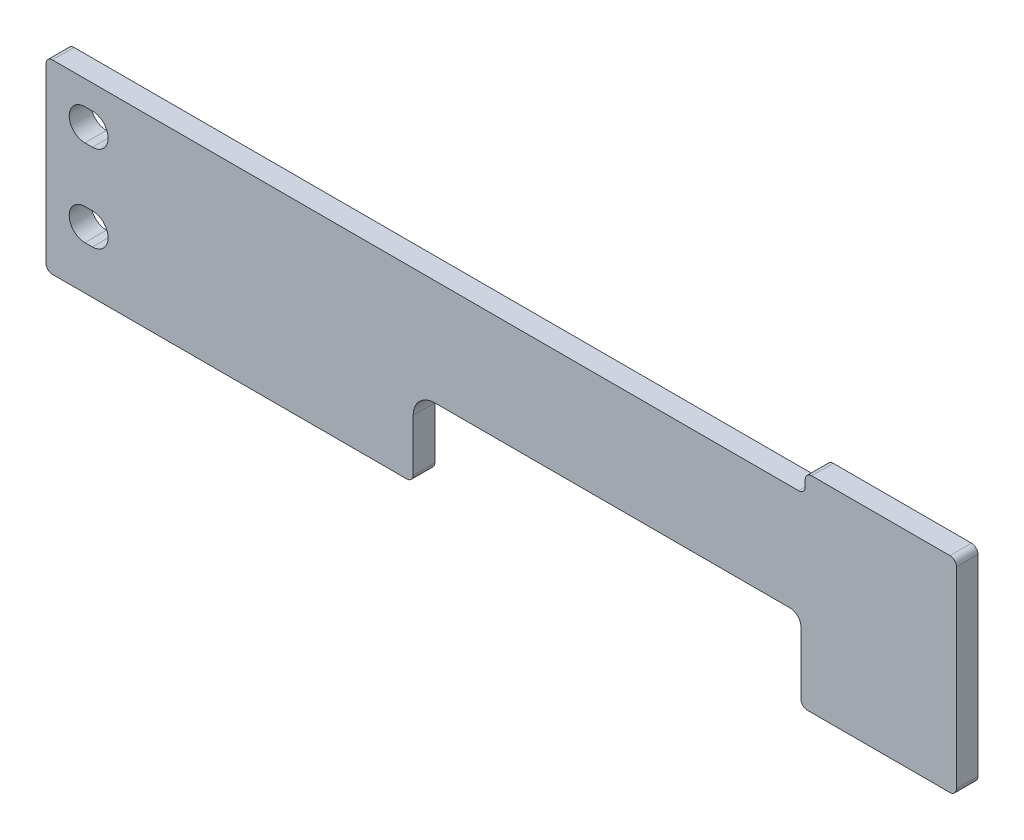
ISO-10303-21;
HEADER;
FILE_DESCRIPTION(('STEP AP214'),'2;1');
FILE_NAME('part.step','',(''),(''),'','','');
FILE_SCHEMA(('AUTOMOTIVE_DESIGN { 1 0 10303 214 1 1 1 1 }'));
ENDSEC;
DATA;
#1=APPLICATION_CONTEXT('core data for automotive mechanical design processes');
#2=APPLICATION_PROTOCOL_DEFINITION('international standard','automotive_design',2000,#1);
#3=PRODUCT_CONTEXT('',#1,'mechanical');
#4=PRODUCT('Part','Part','',(#3));
#5=PRODUCT_RELATED_PRODUCT_CATEGORY('part','',(#4));
#6=PRODUCT_DEFINITION_FORMATION('','',#4);
#7=PRODUCT_DEFINITION_CONTEXT('part definition',#1,'design');
#8=PRODUCT_DEFINITION('design','',#6,#7);
#9=PRODUCT_DEFINITION_SHAPE('','',#8);
#10=(LENGTH_UNIT() NAMED_UNIT(*) SI_UNIT(.MILLI.,.METRE.));
#11=(NAMED_UNIT(*) PLANE_ANGLE_UNIT() SI_UNIT($,.RADIAN.));
#12=(NAMED_UNIT(*) SI_UNIT($,.STERADIAN.) SOLID_ANGLE_UNIT());
#13=UNCERTAINTY_MEASURE_WITH_UNIT(LENGTH_MEASURE(1.E-05),#10,'distance_accuracy_value','');
#14=(GEOMETRIC_REPRESENTATION_CONTEXT(3) GLOBAL_UNCERTAINTY_ASSIGNED_CONTEXT((#13)) GLOBAL_UNIT_ASSIGNED_CONTEXT((#10,
#11,#12)) REPRESENTATION_CONTEXT('',''));
#15=CARTESIAN_POINT('',(0.,0.,0.));
#16=DIRECTION('',(0.,0.,1.));
#17=DIRECTION('',(1.,0.,0.));
#18=AXIS2_PLACEMENT_3D('',#15,#16,#17);
#19=CARTESIAN_POINT('',(-418.5,-12.,10.));
#20=DIRECTION('',(0.,0.,1.));
#21=DIRECTION('',(1.,0.,0.));
#22=AXIS2_PLACEMENT_3D('',#19,#20,#21);
#23=PLANE('',#22);
#24=DIRECTION('',(1.,0.,0.));
#25=VECTOR('',#24,1.);
#26=CARTESIAN_POINT('',(-403.5,-74.75,10.));
#27=LINE('',#26,#25);
#28=CARTESIAN_POINT('',(-403.5,-74.75,10.));
#29=VERTEX_POINT('',#28);
#30=CARTESIAN_POINT('',(-400.,-74.75,10.));
#31=VERTEX_POINT('',#30);
#32=EDGE_CURVE('E262',#29,#31,#27,.T.);
#33=ORIENTED_EDGE('',*,*,#32,.F.);
#34=CARTESIAN_POINT('',(-403.5,-67.5,10.));
#35=DIRECTION('',(0.,0.,1.));
#36=DIRECTION('',(1.,0.,0.));
#37=AXIS2_PLACEMENT_3D('',#34,#35,#36);
#38=CIRCLE('',#37,7.25);
#39=CARTESIAN_POINT('',(-403.5,-60.25,10.));
#40=VERTEX_POINT('',#39);
#41=EDGE_CURVE('E260',#40,#29,#38,.T.);
#42=ORIENTED_EDGE('',*,*,#41,.F.);
#43=DIRECTION('',(-1.,0.,0.));
#44=VECTOR('',#43,1.);
#45=CARTESIAN_POINT('',(-400.,-60.25,10.));
#46=LINE('',#45,#44);
#47=CARTESIAN_POINT('',(-400.,-60.25,10.));
#48=VERTEX_POINT('',#47);
#49=EDGE_CURVE('E268',#48,#40,#46,.T.);
#50=ORIENTED_EDGE('',*,*,#49,.F.);
#51=CARTESIAN_POINT('',(-400.,-67.5,10.));
#52=DIRECTION('',(0.,0.,1.));
#53=DIRECTION('',(1.,0.,0.));
#54=AXIS2_PLACEMENT_3D('',#51,#52,#53);
#55=CIRCLE('',#54,7.25);
#56=EDGE_CURVE('E265',#31,#48,#55,.T.);
#57=ORIENTED_EDGE('',*,*,#56,.F.);
#58=EDGE_LOOP('',(#33,#42,#50,#57));
#59=FACE_BOUND('',#58,.T.);
#60=CARTESIAN_POINT('',(-418.5,-12.,10.));
#61=DIRECTION('',(0.,0.,1.));
#62=DIRECTION('',(1.,0.,0.));
#63=AXIS2_PLACEMENT_3D('',#60,#61,#62);
#64=CIRCLE('',#63,3.);
#65=CARTESIAN_POINT('',(-418.5,-9.00000000000004,10.));
#66=VERTEX_POINT('',#65);
#67=CARTESIAN_POINT('',(-421.5,-12.,10.));
#68=VERTEX_POINT('',#67);
#69=EDGE_CURVE('E291',#66,#68,#64,.T.);
#70=ORIENTED_EDGE('',*,*,#69,.T.);
#71=DIRECTION('',(0.,-1.,0.));
#72=VECTOR('',#71,1.);
#73=CARTESIAN_POINT('',(-421.5,-12.,10.));
#74=LINE('',#73,#72);
#75=CARTESIAN_POINT('',(-421.5,-92.,9.99999999999999));
#76=VERTEX_POINT('',#75);
#77=EDGE_CURVE('E294',#68,#76,#74,.T.);
#78=ORIENTED_EDGE('',*,*,#77,.T.);
#79=CARTESIAN_POINT('',(-418.5,-92.,10.));
#80=DIRECTION('',(0.,0.,1.));
#81=DIRECTION('',(1.,0.,0.));
#82=AXIS2_PLACEMENT_3D('',#79,#80,#81);
#83=CIRCLE('',#82,3.);
#84=CARTESIAN_POINT('',(-418.5,-95.,10.));
#85=VERTEX_POINT('',#84);
#86=EDGE_CURVE('E297',#76,#85,#83,.T.);
#87=ORIENTED_EDGE('',*,*,#86,.T.);
#88=DIRECTION('',(1.,0.,0.));
#89=VECTOR('',#88,1.);
#90=CARTESIAN_POINT('',(-418.5,-95.,10.));
#91=LINE('',#90,#89);
#92=CARTESIAN_POINT('',(-254.5,-95.,10.));
#93=VERTEX_POINT('',#92);
#94=EDGE_CURVE('E299',#85,#93,#91,.T.);
#95=ORIENTED_EDGE('',*,*,#94,.T.);
#96=CARTESIAN_POINT('',(-254.5,-92.,10.));
#97=DIRECTION('',(0.,0.,1.));
#98=DIRECTION('',(1.,0.,0.));
#99=AXIS2_PLACEMENT_3D('',#96,#97,#98);
#100=CIRCLE('',#99,3.);
#101=CARTESIAN_POINT('',(-251.5,-92.,9.99999999999999));
#102=VERTEX_POINT('',#101);
#103=EDGE_CURVE('E301',#93,#102,#100,.T.);
#104=ORIENTED_EDGE('',*,*,#103,.T.);
#105=DIRECTION('',(0.,1.,0.));
#106=VECTOR('',#105,1.);
#107=CARTESIAN_POINT('',(-251.5,-92.,9.99999999999999));
#108=LINE('',#107,#106);
#109=CARTESIAN_POINT('',(-251.5,-68.,10.));
#110=VERTEX_POINT('',#109);
#111=EDGE_CURVE('E303',#102,#110,#108,.T.);
#112=ORIENTED_EDGE('',*,*,#111,.T.);
#113=CARTESIAN_POINT('',(-241.5,-68.,10.));
#114=DIRECTION('',(0.,0.,-1.));
#115=DIRECTION('',(-1.,0.,0.));
#116=AXIS2_PLACEMENT_3D('',#113,#114,#115);
#117=CIRCLE('',#116,10.);
#118=CARTESIAN_POINT('',(-241.5,-58.,10.));
#119=VERTEX_POINT('',#118);
#120=EDGE_CURVE('E305',#110,#119,#117,.T.);
#121=ORIENTED_EDGE('',*,*,#120,.T.);
#122=DIRECTION('',(1.,0.,0.));
#123=VECTOR('',#122,1.);
#124=CARTESIAN_POINT('',(-241.5,-58.,10.));
#125=LINE('',#124,#123);
#126=CARTESIAN_POINT('',(-77.,-58.,10.));
#127=VERTEX_POINT('',#126);
#128=EDGE_CURVE('E307',#119,#127,#125,.T.);
#129=ORIENTED_EDGE('',*,*,#128,.T.);
#130=CARTESIAN_POINT('',(-77.,-63.,10.));
#131=DIRECTION('',(0.,0.,-1.));
#132=DIRECTION('',(-1.,0.,0.));
#133=AXIS2_PLACEMENT_3D('',#130,#131,#132);
#134=CIRCLE('',#133,5.00000000000001);
#135=CARTESIAN_POINT('',(-72.,-63.,10.));
#136=VERTEX_POINT('',#135);
#137=EDGE_CURVE('E309',#127,#136,#134,.T.);
#138=ORIENTED_EDGE('',*,*,#137,.T.);
#139=DIRECTION('',(0.,-1.,0.));
#140=VECTOR('',#139,1.);
#141=CARTESIAN_POINT('',(-72.,-63.,10.));
#142=LINE('',#141,#140);
#143=CARTESIAN_POINT('',(-72.,-92.,10.));
#144=VERTEX_POINT('',#143);
#145=EDGE_CURVE('E311',#136,#144,#142,.T.);
#146=ORIENTED_EDGE('',*,*,#145,.T.);
#147=CARTESIAN_POINT('',(-69.,-92.,10.));
#148=DIRECTION('',(0.,0.,1.));
#149=DIRECTION('',(1.,0.,0.));
#150=AXIS2_PLACEMENT_3D('',#147,#148,#149);
#151=CIRCLE('',#150,3.);
#152=CARTESIAN_POINT('',(-69.,-95.,10.));
#153=VERTEX_POINT('',#152);
#154=EDGE_CURVE('E313',#144,#153,#151,.T.);
#155=ORIENTED_EDGE('',*,*,#154,.T.);
#156=DIRECTION('',(1.,0.,0.));
#157=VECTOR('',#156,1.);
#158=CARTESIAN_POINT('',(-69.,-95.,10.));
#159=LINE('',#158,#157);
#160=CARTESIAN_POINT('',(-3.,-95.,10.));
#161=VERTEX_POINT('',#160);
#162=EDGE_CURVE('E315',#153,#161,#159,.T.);
#163=ORIENTED_EDGE('',*,*,#162,.T.);
#164=CARTESIAN_POINT('',(-3.,-92.,10.));
#165=DIRECTION('',(0.,0.,1.));
#166=DIRECTION('',(1.,0.,0.));
#167=AXIS2_PLACEMENT_3D('',#164,#165,#166);
#168=CIRCLE('',#167,3.);
#169=CARTESIAN_POINT('',(0.,-92.,9.99999999999999));
#170=VERTEX_POINT('',#169);
#171=EDGE_CURVE('E317',#161,#170,#168,.T.);
#172=ORIENTED_EDGE('',*,*,#171,.T.);
#173=DIRECTION('',(0.,1.,0.));
#174=VECTOR('',#173,1.);
#175=CARTESIAN_POINT('',(0.,-92.,9.99999999999999));
#176=LINE('',#175,#174);
#177=CARTESIAN_POINT('',(0.,-3.00000000000002,10.));
#178=VERTEX_POINT('',#177);
#179=EDGE_CURVE('E319',#170,#178,#176,.T.);
#180=ORIENTED_EDGE('',*,*,#179,.T.);
#181=CARTESIAN_POINT('',(-3.,-3.,10.));
#182=DIRECTION('',(0.,0.,1.));
#183=DIRECTION('',(-1.,0.,0.));
#184=AXIS2_PLACEMENT_3D('',#181,#182,#183);
#185=CIRCLE('',#184,3.);
#186=CARTESIAN_POINT('',(-3.00000000000002,0.,10.));
#187=VERTEX_POINT('',#186);
#188=EDGE_CURVE('E321',#178,#187,#185,.T.);
#189=ORIENTED_EDGE('',*,*,#188,.T.);
#190=DIRECTION('',(-1.,0.,0.));
#191=VECTOR('',#190,1.);
#192=CARTESIAN_POINT('',(-3.00000000000002,0.,10.));
#193=LINE('',#192,#191);
#194=CARTESIAN_POINT('',(-67.,0.,10.));
#195=VERTEX_POINT('',#194);
#196=EDGE_CURVE('E323',#187,#195,#193,.T.);
#197=ORIENTED_EDGE('',*,*,#196,.T.);
#198=CARTESIAN_POINT('',(-67.,-3.,10.));
#199=DIRECTION('',(0.,0.,1.));
#200=DIRECTION('',(1.,0.,0.));
#201=AXIS2_PLACEMENT_3D('',#198,#199,#200);
#202=CIRCLE('',#201,3.);
#203=CARTESIAN_POINT('',(-70.,-3.,10.));
#204=VERTEX_POINT('',#203);
#205=EDGE_CURVE('E325',#195,#204,#202,.T.);
#206=ORIENTED_EDGE('',*,*,#205,.T.);
#207=DIRECTION('',(0.,-1.,0.));
#208=VECTOR('',#207,1.);
#209=CARTESIAN_POINT('',(-70.,-3.,10.));
#210=LINE('',#209,#208);
#211=CARTESIAN_POINT('',(-70.,-6.00000000000001,10.));
#212=VERTEX_POINT('',#211);
#213=EDGE_CURVE('E327',#204,#212,#210,.T.);
#214=ORIENTED_EDGE('',*,*,#213,.T.);
#215=CARTESIAN_POINT('',(-73.,-6.00000000000001,10.));
#216=DIRECTION('',(0.,0.,-1.));
#217=DIRECTION('',(-1.,0.,0.));
#218=AXIS2_PLACEMENT_3D('',#215,#216,#217);
#219=CIRCLE('',#218,2.99999999999999);
#220=CARTESIAN_POINT('',(-73.,-9.00000000000001,10.));
#221=VERTEX_POINT('',#220);
#222=EDGE_CURVE('E329',#212,#221,#219,.T.);
#223=ORIENTED_EDGE('',*,*,#222,.T.);
#224=DIRECTION('',(-1.,0.,0.));
#225=VECTOR('',#224,1.);
#226=CARTESIAN_POINT('',(-73.,-9.00000000000001,10.));
#227=LINE('',#226,#225);
#228=EDGE_CURVE('E331',#221,#66,#227,.T.);
#229=ORIENTED_EDGE('',*,*,#228,.T.);
#230=EDGE_LOOP('',(#70,#78,#87,#95,#104,#112,#121,#129,#138,#146,#155,#163,#172,#180,#189,#197,
#206,#214,#223,#229));
#231=FACE_BOUND('',#230,.T.);
#232=DIRECTION('',(1.,0.,0.));
#233=VECTOR('',#232,1.);
#234=CARTESIAN_POINT('',(-403.5,-34.75,10.));
#235=LINE('',#234,#233);
#236=CARTESIAN_POINT('',(-403.5,-34.75,10.));
#237=VERTEX_POINT('',#236);
#238=CARTESIAN_POINT('',(-400.,-34.75,10.));
#239=VERTEX_POINT('',#238);
#240=EDGE_CURVE('E232',#237,#239,#235,.T.);
#241=ORIENTED_EDGE('',*,*,#240,.F.);
#242=CARTESIAN_POINT('',(-403.5,-27.5,10.));
#243=DIRECTION('',(0.,0.,1.));
#244=DIRECTION('',(1.,0.,0.));
#245=AXIS2_PLACEMENT_3D('',#242,#243,#244);
#246=CIRCLE('',#245,7.25);
#247=CARTESIAN_POINT('',(-403.5,-20.25,10.));
#248=VERTEX_POINT('',#247);
#249=EDGE_CURVE('E224',#248,#237,#246,.T.);
#250=ORIENTED_EDGE('',*,*,#249,.F.);
#251=DIRECTION('',(-1.,0.,0.));
#252=VECTOR('',#251,1.);
#253=CARTESIAN_POINT('',(-400.,-20.25,10.));
#254=LINE('',#253,#252);
#255=CARTESIAN_POINT('',(-400.,-20.25,10.));
#256=VERTEX_POINT('',#255);
#257=EDGE_CURVE('E246',#256,#248,#254,.T.);
#258=ORIENTED_EDGE('',*,*,#257,.F.);
#259=CARTESIAN_POINT('',(-400.,-27.5,10.));
#260=DIRECTION('',(0.,0.,1.));
#261=DIRECTION('',(1.,0.,0.));
#262=AXIS2_PLACEMENT_3D('',#259,#260,#261);
#263=CIRCLE('',#262,7.25);
#264=EDGE_CURVE('E244',#239,#256,#263,.T.);
#265=ORIENTED_EDGE('',*,*,#264,.F.);
#266=EDGE_LOOP('',(#241,#250,#258,#265));
#267=FACE_BOUND('',#266,.T.);
#268=ADVANCED_FACE('F39',(#59,#231,#267),#23,.T.);
#269=CARTESIAN_POINT('',(-418.5,-12.,0.));
#270=DIRECTION('',(0.,0.,1.));
#271=DIRECTION('',(1.,0.,0.));
#272=AXIS2_PLACEMENT_3D('',#269,#270,#271);
#273=PLANE('',#272);
#274=CARTESIAN_POINT('',(-403.5,-67.5,0.));
#275=DIRECTION('',(0.,0.,1.));
#276=DIRECTION('',(1.,0.,0.));
#277=AXIS2_PLACEMENT_3D('',#274,#275,#276);
#278=CIRCLE('',#277,7.25);
#279=CARTESIAN_POINT('',(-403.5,-60.25,0.));
#280=VERTEX_POINT('',#279);
#281=CARTESIAN_POINT('',(-403.5,-74.75,0.));
#282=VERTEX_POINT('',#281);
#283=EDGE_CURVE('E240',#280,#282,#278,.T.);
#284=ORIENTED_EDGE('',*,*,#283,.T.);
#285=DIRECTION('',(1.,0.,0.));
#286=VECTOR('',#285,1.);
#287=CARTESIAN_POINT('',(-403.5,-74.75,0.));
#288=LINE('',#287,#286);
#289=CARTESIAN_POINT('',(-400.,-74.75,0.));
#290=VERTEX_POINT('',#289);
#291=EDGE_CURVE('E273',#282,#290,#288,.T.);
#292=ORIENTED_EDGE('',*,*,#291,.T.);
#293=CARTESIAN_POINT('',(-400.,-67.5,0.));
#294=DIRECTION('',(0.,0.,1.));
#295=DIRECTION('',(1.,0.,0.));
#296=AXIS2_PLACEMENT_3D('',#293,#294,#295);
#297=CIRCLE('',#296,7.25);
#298=CARTESIAN_POINT('',(-400.,-60.25,0.));
#299=VERTEX_POINT('',#298);
#300=EDGE_CURVE('E276',#290,#299,#297,.T.);
#301=ORIENTED_EDGE('',*,*,#300,.T.);
#302=DIRECTION('',(-1.,0.,0.));
#303=VECTOR('',#302,1.);
#304=CARTESIAN_POINT('',(-400.,-60.25,0.));
#305=LINE('',#304,#303);
#306=EDGE_CURVE('E263',#299,#280,#305,.T.);
#307=ORIENTED_EDGE('',*,*,#306,.T.);
#308=EDGE_LOOP('',(#284,#292,#301,#307));
#309=FACE_BOUND('',#308,.T.);
#310=CARTESIAN_POINT('',(-418.5,-12.,0.));
#311=DIRECTION('',(0.,0.,1.));
#312=DIRECTION('',(1.,0.,0.));
#313=AXIS2_PLACEMENT_3D('',#310,#311,#312);
#314=CIRCLE('',#313,3.);
#315=CARTESIAN_POINT('',(-418.5,-9.00000000000004,0.));
#316=VERTEX_POINT('',#315);
#317=CARTESIAN_POINT('',(-421.5,-12.,0.));
#318=VERTEX_POINT('',#317);
#319=EDGE_CURVE('E290',#316,#318,#314,.T.);
#320=ORIENTED_EDGE('',*,*,#319,.F.);
#321=DIRECTION('',(-1.,0.,0.));
#322=VECTOR('',#321,1.);
#323=CARTESIAN_POINT('',(-73.,-9.00000000000001,0.));
#324=LINE('',#323,#322);
#325=CARTESIAN_POINT('',(-73.,-9.00000000000001,0.));
#326=VERTEX_POINT('',#325);
#327=EDGE_CURVE('E295',#326,#316,#324,.T.);
#328=ORIENTED_EDGE('',*,*,#327,.F.);
#329=CARTESIAN_POINT('',(-73.,-6.00000000000001,0.));
#330=DIRECTION('',(0.,0.,-1.));
#331=DIRECTION('',(-1.,0.,0.));
#332=AXIS2_PLACEMENT_3D('',#329,#330,#331);
#333=CIRCLE('',#332,2.99999999999999);
#334=CARTESIAN_POINT('',(-70.,-6.00000000000001,0.));
#335=VERTEX_POINT('',#334);
#336=EDGE_CURVE('E370',#335,#326,#333,.T.);
#337=ORIENTED_EDGE('',*,*,#336,.F.);
#338=DIRECTION('',(0.,-1.,0.));
#339=VECTOR('',#338,1.);
#340=CARTESIAN_POINT('',(-70.,-3.,0.));
#341=LINE('',#340,#339);
#342=CARTESIAN_POINT('',(-70.,-3.,0.));
#343=VERTEX_POINT('',#342);
#344=EDGE_CURVE('E368',#343,#335,#341,.T.);
#345=ORIENTED_EDGE('',*,*,#344,.F.);
#346=CARTESIAN_POINT('',(-67.,-3.,0.));
#347=DIRECTION('',(0.,0.,1.));
#348=DIRECTION('',(1.,0.,0.));
#349=AXIS2_PLACEMENT_3D('',#346,#347,#348);
#350=CIRCLE('',#349,3.);
#351=CARTESIAN_POINT('',(-67.,0.,0.));
#352=VERTEX_POINT('',#351);
#353=EDGE_CURVE('E366',#352,#343,#350,.T.);
#354=ORIENTED_EDGE('',*,*,#353,.F.);
#355=DIRECTION('',(-1.,0.,0.));
#356=VECTOR('',#355,1.);
#357=CARTESIAN_POINT('',(-3.00000000000002,0.,0.));
#358=LINE('',#357,#356);
#359=CARTESIAN_POINT('',(-3.00000000000002,0.,0.));
#360=VERTEX_POINT('',#359);
#361=EDGE_CURVE('E364',#360,#352,#358,.T.);
#362=ORIENTED_EDGE('',*,*,#361,.F.);
#363=CARTESIAN_POINT('',(-3.,-3.,0.));
#364=DIRECTION('',(0.,0.,1.));
#365=DIRECTION('',(-1.,0.,0.));
#366=AXIS2_PLACEMENT_3D('',#363,#364,#365);
#367=CIRCLE('',#366,3.);
#368=CARTESIAN_POINT('',(0.,-3.00000000000002,0.));
#369=VERTEX_POINT('',#368);
#370=EDGE_CURVE('E362',#369,#360,#367,.T.);
#371=ORIENTED_EDGE('',*,*,#370,.F.);
#372=DIRECTION('',(0.,1.,0.));
#373=VECTOR('',#372,1.);
#374=CARTESIAN_POINT('',(0.,-92.,0.));
#375=LINE('',#374,#373);
#376=CARTESIAN_POINT('',(0.,-92.,0.));
#377=VERTEX_POINT('',#376);
#378=EDGE_CURVE('E360',#377,#369,#375,.T.);
#379=ORIENTED_EDGE('',*,*,#378,.F.);
#380=CARTESIAN_POINT('',(-3.,-92.,0.));
#381=DIRECTION('',(0.,0.,1.));
#382=DIRECTION('',(1.,0.,0.));
#383=AXIS2_PLACEMENT_3D('',#380,#381,#382);
#384=CIRCLE('',#383,3.);
#385=CARTESIAN_POINT('',(-3.,-95.,0.));
#386=VERTEX_POINT('',#385);
#387=EDGE_CURVE('E358',#386,#377,#384,.T.);
#388=ORIENTED_EDGE('',*,*,#387,.F.);
#389=DIRECTION('',(1.,0.,0.));
#390=VECTOR('',#389,1.);
#391=CARTESIAN_POINT('',(-69.,-95.,0.));
#392=LINE('',#391,#390);
#393=CARTESIAN_POINT('',(-69.,-95.,0.));
#394=VERTEX_POINT('',#393);
#395=EDGE_CURVE('E356',#394,#386,#392,.T.);
#396=ORIENTED_EDGE('',*,*,#395,.F.);
#397=CARTESIAN_POINT('',(-69.,-92.,0.));
#398=DIRECTION('',(0.,0.,1.));
#399=DIRECTION('',(1.,0.,0.));
#400=AXIS2_PLACEMENT_3D('',#397,#398,#399);
#401=CIRCLE('',#400,3.);
#402=CARTESIAN_POINT('',(-72.,-92.,0.));
#403=VERTEX_POINT('',#402);
#404=EDGE_CURVE('E354',#403,#394,#401,.T.);
#405=ORIENTED_EDGE('',*,*,#404,.F.);
#406=DIRECTION('',(0.,-1.,0.));
#407=VECTOR('',#406,1.);
#408=CARTESIAN_POINT('',(-72.,-63.,0.));
#409=LINE('',#408,#407);
#410=CARTESIAN_POINT('',(-72.,-63.,0.));
#411=VERTEX_POINT('',#410);
#412=EDGE_CURVE('E352',#411,#403,#409,.T.);
#413=ORIENTED_EDGE('',*,*,#412,.F.);
#414=CARTESIAN_POINT('',(-77.,-63.,0.));
#415=DIRECTION('',(0.,0.,-1.));
#416=DIRECTION('',(-1.,0.,0.));
#417=AXIS2_PLACEMENT_3D('',#414,#415,#416);
#418=CIRCLE('',#417,5.00000000000001);
#419=CARTESIAN_POINT('',(-77.,-58.,0.));
#420=VERTEX_POINT('',#419);
#421=EDGE_CURVE('E350',#420,#411,#418,.T.);
#422=ORIENTED_EDGE('',*,*,#421,.F.);
#423=DIRECTION('',(1.,0.,0.));
#424=VECTOR('',#423,1.);
#425=CARTESIAN_POINT('',(-241.5,-58.,0.));
#426=LINE('',#425,#424);
#427=CARTESIAN_POINT('',(-241.5,-58.,0.));
#428=VERTEX_POINT('',#427);
#429=EDGE_CURVE('E348',#428,#420,#426,.T.);
#430=ORIENTED_EDGE('',*,*,#429,.F.);
#431=CARTESIAN_POINT('',(-241.5,-68.,0.));
#432=DIRECTION('',(0.,0.,-1.));
#433=DIRECTION('',(-1.,0.,0.));
#434=AXIS2_PLACEMENT_3D('',#431,#432,#433);
#435=CIRCLE('',#434,10.);
#436=CARTESIAN_POINT('',(-251.5,-68.,0.));
#437=VERTEX_POINT('',#436);
#438=EDGE_CURVE('E346',#437,#428,#435,.T.);
#439=ORIENTED_EDGE('',*,*,#438,.F.);
#440=DIRECTION('',(0.,1.,0.));
#441=VECTOR('',#440,1.);
#442=CARTESIAN_POINT('',(-251.5,-92.,0.));
#443=LINE('',#442,#441);
#444=CARTESIAN_POINT('',(-251.5,-92.,0.));
#445=VERTEX_POINT('',#444);
#446=EDGE_CURVE('E344',#445,#437,#443,.T.);
#447=ORIENTED_EDGE('',*,*,#446,.F.);
#448=CARTESIAN_POINT('',(-254.5,-92.,0.));
#449=DIRECTION('',(0.,0.,1.));
#450=DIRECTION('',(1.,0.,0.));
#451=AXIS2_PLACEMENT_3D('',#448,#449,#450);
#452=CIRCLE('',#451,3.);
#453=CARTESIAN_POINT('',(-254.5,-95.,0.));
#454=VERTEX_POINT('',#453);
#455=EDGE_CURVE('E342',#454,#445,#452,.T.);
#456=ORIENTED_EDGE('',*,*,#455,.F.);
#457=DIRECTION('',(1.,0.,0.));
#458=VECTOR('',#457,1.);
#459=CARTESIAN_POINT('',(-418.5,-95.,0.));
#460=LINE('',#459,#458);
#461=CARTESIAN_POINT('',(-418.5,-95.,0.));
#462=VERTEX_POINT('',#461);
#463=EDGE_CURVE('E340',#462,#454,#460,.T.);
#464=ORIENTED_EDGE('',*,*,#463,.F.);
#465=CARTESIAN_POINT('',(-418.5,-92.,0.));
#466=DIRECTION('',(0.,0.,1.));
#467=DIRECTION('',(1.,0.,0.));
#468=AXIS2_PLACEMENT_3D('',#465,#466,#467);
#469=CIRCLE('',#468,3.);
#470=CARTESIAN_POINT('',(-421.5,-92.,0.));
#471=VERTEX_POINT('',#470);
#472=EDGE_CURVE('E338',#471,#462,#469,.T.);
#473=ORIENTED_EDGE('',*,*,#472,.F.);
#474=DIRECTION('',(0.,-1.,0.));
#475=VECTOR('',#474,1.);
#476=CARTESIAN_POINT('',(-421.5,-12.,0.));
#477=LINE('',#476,#475);
#478=EDGE_CURVE('E336',#318,#471,#477,.T.);
#479=ORIENTED_EDGE('',*,*,#478,.F.);
#480=EDGE_LOOP('',(#320,#328,#337,#345,#354,#362,#371,#379,#388,#396,#405,#413,#422,#430,#439,
#447,#456,#464,#473,#479));
#481=FACE_BOUND('',#480,.T.);
#482=CARTESIAN_POINT('',(-403.5,-27.5,0.));
#483=DIRECTION('',(0.,0.,1.));
#484=DIRECTION('',(1.,0.,0.));
#485=AXIS2_PLACEMENT_3D('',#482,#483,#484);
#486=CIRCLE('',#485,7.25);
#487=CARTESIAN_POINT('',(-403.5,-20.25,0.));
#488=VERTEX_POINT('',#487);
#489=CARTESIAN_POINT('',(-403.5,-34.75,0.));
#490=VERTEX_POINT('',#489);
#491=EDGE_CURVE('E62',#488,#490,#486,.T.);
#492=ORIENTED_EDGE('',*,*,#491,.T.);
#493=DIRECTION('',(1.,0.,0.));
#494=VECTOR('',#493,1.);
#495=CARTESIAN_POINT('',(-403.5,-34.75,0.));
#496=LINE('',#495,#494);
#497=CARTESIAN_POINT('',(-400.,-34.75,0.));
#498=VERTEX_POINT('',#497);
#499=EDGE_CURVE('E239',#490,#498,#496,.T.);
#500=ORIENTED_EDGE('',*,*,#499,.T.);
#501=CARTESIAN_POINT('',(-400.,-27.5,0.));
#502=DIRECTION('',(0.,0.,1.));
#503=DIRECTION('',(1.,0.,0.));
#504=AXIS2_PLACEMENT_3D('',#501,#502,#503);
#505=CIRCLE('',#504,7.25);
#506=CARTESIAN_POINT('',(-400.,-20.25,0.));
#507=VERTEX_POINT('',#506);
#508=EDGE_CURVE('E252',#498,#507,#505,.T.);
#509=ORIENTED_EDGE('',*,*,#508,.T.);
#510=DIRECTION('',(-1.,0.,0.));
#511=VECTOR('',#510,1.);
#512=CARTESIAN_POINT('',(-400.,-20.25,0.));
#513=LINE('',#512,#511);
#514=EDGE_CURVE('E233',#507,#488,#513,.T.);
#515=ORIENTED_EDGE('',*,*,#514,.T.);
#516=EDGE_LOOP('',(#492,#500,#509,#515));
#517=FACE_BOUND('',#516,.T.);
#518=ADVANCED_FACE('F436',(#309,#481,#517),#273,.F.);
#519=CARTESIAN_POINT('',(-418.5,-12.,10.));
#520=DIRECTION('',(0.,0.,-1.));
#521=DIRECTION('',(-1.,0.,0.));
#522=AXIS2_PLACEMENT_3D('',#519,#520,#521);
#523=CYLINDRICAL_SURFACE('',#522,3.);
#524=ORIENTED_EDGE('',*,*,#319,.T.);
#525=DIRECTION('',(0.,0.,-1.));
#526=VECTOR('',#525,1.);
#527=CARTESIAN_POINT('',(-421.5,-12.,10.));
#528=LINE('',#527,#526);
#529=EDGE_CURVE('E11',#68,#318,#528,.T.);
#530=ORIENTED_EDGE('',*,*,#529,.F.);
#531=ORIENTED_EDGE('',*,*,#69,.F.);
#532=DIRECTION('',(0.,0.,-1.));
#533=VECTOR('',#532,1.);
#534=CARTESIAN_POINT('',(-418.5,-9.00000000000004,10.));
#535=LINE('',#534,#533);
#536=EDGE_CURVE('E333',#66,#316,#535,.T.);
#537=ORIENTED_EDGE('',*,*,#536,.T.);
#538=EDGE_LOOP('',(#524,#530,#531,#537));
#539=FACE_BOUND('',#538,.T.);
#540=ADVANCED_FACE('F41',(#539),#523,.T.);
#541=CARTESIAN_POINT('',(-421.5,-12.,10.));
#542=DIRECTION('',(1.,0.,0.));
#543=DIRECTION('',(0.,0.,-1.));
#544=AXIS2_PLACEMENT_3D('',#541,#542,#543);
#545=PLANE('',#544);
#546=ORIENTED_EDGE('',*,*,#478,.T.);
#547=DIRECTION('',(0.,0.,-1.));
#548=VECTOR('',#547,1.);
#549=CARTESIAN_POINT('',(-421.5,-92.,9.99999999999999));
#550=LINE('',#549,#548);
#551=EDGE_CURVE('E47',#76,#471,#550,.T.);
#552=ORIENTED_EDGE('',*,*,#551,.F.);
#553=ORIENTED_EDGE('',*,*,#77,.F.);
#554=ORIENTED_EDGE('',*,*,#529,.T.);
#555=EDGE_LOOP('',(#546,#552,#553,#554));
#556=FACE_BOUND('',#555,.T.);
#557=ADVANCED_FACE('F453',(#556),#545,.F.);
#558=CARTESIAN_POINT('',(-418.5,-92.,10.));
#559=DIRECTION('',(0.,0.,-1.));
#560=DIRECTION('',(-1.,0.,0.));
#561=AXIS2_PLACEMENT_3D('',#558,#559,#560);
#562=CYLINDRICAL_SURFACE('',#561,3.);
#563=ORIENTED_EDGE('',*,*,#472,.T.);
#564=DIRECTION('',(0.,0.,-1.));
#565=VECTOR('',#564,1.);
#566=CARTESIAN_POINT('',(-418.5,-95.,10.));
#567=LINE('',#566,#565);
#568=EDGE_CURVE('E423',#85,#462,#567,.T.);
#569=ORIENTED_EDGE('',*,*,#568,.F.);
#570=ORIENTED_EDGE('',*,*,#86,.F.);
#571=ORIENTED_EDGE('',*,*,#551,.T.);
#572=EDGE_LOOP('',(#563,#569,#570,#571));
#573=FACE_BOUND('',#572,.T.);
#574=ADVANCED_FACE('F430',(#573),#562,.T.);
#575=CARTESIAN_POINT('',(-418.5,-95.,10.));
#576=DIRECTION('',(0.,1.,0.));
#577=DIRECTION('',(0.,0.,1.));
#578=AXIS2_PLACEMENT_3D('',#575,#576,#577);
#579=PLANE('',#578);
#580=ORIENTED_EDGE('',*,*,#463,.T.);
#581=DIRECTION('',(0.,0.,-1.));
#582=VECTOR('',#581,1.);
#583=CARTESIAN_POINT('',(-254.5,-95.,10.));
#584=LINE('',#583,#582);
#585=EDGE_CURVE('E420',#93,#454,#584,.T.);
#586=ORIENTED_EDGE('',*,*,#585,.F.);
#587=ORIENTED_EDGE('',*,*,#94,.F.);
#588=ORIENTED_EDGE('',*,*,#568,.T.);
#589=EDGE_LOOP('',(#580,#586,#587,#588));
#590=FACE_BOUND('',#589,.T.);
#591=ADVANCED_FACE('F442',(#590),#579,.F.);
#592=CARTESIAN_POINT('',(-254.5,-92.,10.));
#593=DIRECTION('',(0.,0.,-1.));
#594=DIRECTION('',(-1.,0.,0.));
#595=AXIS2_PLACEMENT_3D('',#592,#593,#594);
#596=CYLINDRICAL_SURFACE('',#595,3.);
#597=ORIENTED_EDGE('',*,*,#455,.T.);
#598=DIRECTION('',(0.,0.,-1.));
#599=VECTOR('',#598,1.);
#600=CARTESIAN_POINT('',(-251.5,-92.,9.99999999999999));
#601=LINE('',#600,#599);
#602=EDGE_CURVE('E417',#102,#445,#601,.T.);
#603=ORIENTED_EDGE('',*,*,#602,.F.);
#604=ORIENTED_EDGE('',*,*,#103,.F.);
#605=ORIENTED_EDGE('',*,*,#585,.T.);
#606=EDGE_LOOP('',(#597,#603,#604,#605));
#607=FACE_BOUND('',#606,.T.);
#608=ADVANCED_FACE('F446',(#607),#596,.T.);
#609=CARTESIAN_POINT('',(-251.5,-92.,9.99999999999999));
#610=DIRECTION('',(-1.,0.,0.));
#611=DIRECTION('',(0.,0.,1.));
#612=AXIS2_PLACEMENT_3D('',#609,#610,#611);
#613=PLANE('',#612);
#614=ORIENTED_EDGE('',*,*,#446,.T.);
#615=DIRECTION('',(0.,0.,-1.));
#616=VECTOR('',#615,1.);
#617=CARTESIAN_POINT('',(-251.5,-68.,10.));
#618=LINE('',#617,#616);
#619=EDGE_CURVE('E414',#110,#437,#618,.T.);
#620=ORIENTED_EDGE('',*,*,#619,.F.);
#621=ORIENTED_EDGE('',*,*,#111,.F.);
#622=ORIENTED_EDGE('',*,*,#602,.T.);
#623=EDGE_LOOP('',(#614,#620,#621,#622));
#624=FACE_BOUND('',#623,.T.);
#625=ADVANCED_FACE('F526',(#624),#613,.F.);
#626=CARTESIAN_POINT('',(-241.5,-68.,10.));
#627=DIRECTION('',(0.,0.,-1.));
#628=DIRECTION('',(-1.,0.,0.));
#629=AXIS2_PLACEMENT_3D('',#626,#627,#628);
#630=CYLINDRICAL_SURFACE('',#629,10.);
#631=ORIENTED_EDGE('',*,*,#438,.T.);
#632=DIRECTION('',(0.,0.,-1.));
#633=VECTOR('',#632,1.);
#634=CARTESIAN_POINT('',(-241.5,-58.,10.));
#635=LINE('',#634,#633);
#636=EDGE_CURVE('E411',#119,#428,#635,.T.);
#637=ORIENTED_EDGE('',*,*,#636,.F.);
#638=ORIENTED_EDGE('',*,*,#120,.F.);
#639=ORIENTED_EDGE('',*,*,#619,.T.);
#640=EDGE_LOOP('',(#631,#637,#638,#639));
#641=FACE_BOUND('',#640,.T.);
#642=ADVANCED_FACE('F524',(#641),#630,.F.);
#643=CARTESIAN_POINT('',(-241.5,-58.,10.));
#644=DIRECTION('',(0.,1.,0.));
#645=DIRECTION('',(-1.,0.,0.));
#646=AXIS2_PLACEMENT_3D('',#643,#644,#645);
#647=PLANE('',#646);
#648=ORIENTED_EDGE('',*,*,#429,.T.);
#649=DIRECTION('',(0.,0.,-1.));
#650=VECTOR('',#649,1.);
#651=CARTESIAN_POINT('',(-77.,-58.,10.));
#652=LINE('',#651,#650);
#653=EDGE_CURVE('E408',#127,#420,#652,.T.);
#654=ORIENTED_EDGE('',*,*,#653,.F.);
#655=ORIENTED_EDGE('',*,*,#128,.F.);
#656=ORIENTED_EDGE('',*,*,#636,.T.);
#657=EDGE_LOOP('',(#648,#654,#655,#656));
#658=FACE_BOUND('',#657,.T.);
#659=ADVANCED_FACE('F519',(#658),#647,.F.);
#660=CARTESIAN_POINT('',(-77.,-63.,10.));
#661=DIRECTION('',(0.,0.,-1.));
#662=DIRECTION('',(-1.,0.,0.));
#663=AXIS2_PLACEMENT_3D('',#660,#661,#662);
#664=CYLINDRICAL_SURFACE('',#663,5.00000000000001);
#665=ORIENTED_EDGE('',*,*,#421,.T.);
#666=DIRECTION('',(0.,0.,-1.));
#667=VECTOR('',#666,1.);
#668=CARTESIAN_POINT('',(-72.,-63.,10.));
#669=LINE('',#668,#667);
#670=EDGE_CURVE('E405',#136,#411,#669,.T.);
#671=ORIENTED_EDGE('',*,*,#670,.F.);
#672=ORIENTED_EDGE('',*,*,#137,.F.);
#673=ORIENTED_EDGE('',*,*,#653,.T.);
#674=EDGE_LOOP('',(#665,#671,#672,#673));
#675=FACE_BOUND('',#674,.T.);
#676=ADVANCED_FACE('F514',(#675),#664,.F.);
#677=CARTESIAN_POINT('',(-72.,-63.,10.));
#678=DIRECTION('',(1.,0.,0.));
#679=DIRECTION('',(0.,1.,0.));
#680=AXIS2_PLACEMENT_3D('',#677,#678,#679);
#681=PLANE('',#680);
#682=ORIENTED_EDGE('',*,*,#412,.T.);
#683=DIRECTION('',(0.,0.,-1.));
#684=VECTOR('',#683,1.);
#685=CARTESIAN_POINT('',(-72.,-92.,10.));
#686=LINE('',#685,#684);
#687=EDGE_CURVE('E402',#144,#403,#686,.T.);
#688=ORIENTED_EDGE('',*,*,#687,.F.);
#689=ORIENTED_EDGE('',*,*,#145,.F.);
#690=ORIENTED_EDGE('',*,*,#670,.T.);
#691=EDGE_LOOP('',(#682,#688,#689,#690));
#692=FACE_BOUND('',#691,.T.);
#693=ADVANCED_FACE('F510',(#692),#681,.F.);
#694=CARTESIAN_POINT('',(-69.,-92.,10.));
#695=DIRECTION('',(0.,0.,-1.));
#696=DIRECTION('',(-1.,0.,0.));
#697=AXIS2_PLACEMENT_3D('',#694,#695,#696);
#698=CYLINDRICAL_SURFACE('',#697,3.);
#699=ORIENTED_EDGE('',*,*,#404,.T.);
#700=DIRECTION('',(0.,0.,-1.));
#701=VECTOR('',#700,1.);
#702=CARTESIAN_POINT('',(-69.,-95.,10.));
#703=LINE('',#702,#701);
#704=EDGE_CURVE('E399',#153,#394,#703,.T.);
#705=ORIENTED_EDGE('',*,*,#704,.F.);
#706=ORIENTED_EDGE('',*,*,#154,.F.);
#707=ORIENTED_EDGE('',*,*,#687,.T.);
#708=EDGE_LOOP('',(#699,#705,#706,#707));
#709=FACE_BOUND('',#708,.T.);
#710=ADVANCED_FACE('F505',(#709),#698,.T.);
#711=CARTESIAN_POINT('',(-69.,-95.,10.));
#712=DIRECTION('',(0.,1.,0.));
#713=DIRECTION('',(0.,0.,1.));
#714=AXIS2_PLACEMENT_3D('',#711,#712,#713);
#715=PLANE('',#714);
#716=ORIENTED_EDGE('',*,*,#395,.T.);
#717=DIRECTION('',(0.,0.,-1.));
#718=VECTOR('',#717,1.);
#719=CARTESIAN_POINT('',(-3.,-95.,10.));
#720=LINE('',#719,#718);
#721=EDGE_CURVE('E396',#161,#386,#720,.T.);
#722=ORIENTED_EDGE('',*,*,#721,.F.);
#723=ORIENTED_EDGE('',*,*,#162,.F.);
#724=ORIENTED_EDGE('',*,*,#704,.T.);
#725=EDGE_LOOP('',(#716,#722,#723,#724));
#726=FACE_BOUND('',#725,.T.);
#727=ADVANCED_FACE('F499',(#726),#715,.F.);
#728=CARTESIAN_POINT('',(-3.,-92.,10.));
#729=DIRECTION('',(0.,0.,-1.));
#730=DIRECTION('',(-1.,0.,0.));
#731=AXIS2_PLACEMENT_3D('',#728,#729,#730);
#732=CYLINDRICAL_SURFACE('',#731,3.);
#733=ORIENTED_EDGE('',*,*,#387,.T.);
#734=DIRECTION('',(0.,0.,-1.));
#735=VECTOR('',#734,1.);
#736=CARTESIAN_POINT('',(0.,-92.,9.99999999999999));
#737=LINE('',#736,#735);
#738=EDGE_CURVE('E393',#170,#377,#737,.T.);
#739=ORIENTED_EDGE('',*,*,#738,.F.);
#740=ORIENTED_EDGE('',*,*,#171,.F.);
#741=ORIENTED_EDGE('',*,*,#721,.T.);
#742=EDGE_LOOP('',(#733,#739,#740,#741));
#743=FACE_BOUND('',#742,.T.);
#744=ADVANCED_FACE('F495',(#743),#732,.T.);
#745=CARTESIAN_POINT('',(0.,-92.,9.99999999999999));
#746=DIRECTION('',(-1.,0.,0.));
#747=DIRECTION('',(0.,0.,1.));
#748=AXIS2_PLACEMENT_3D('',#745,#746,#747);
#749=PLANE('',#748);
#750=ORIENTED_EDGE('',*,*,#378,.T.);
#751=DIRECTION('',(0.,0.,-1.));
#752=VECTOR('',#751,1.);
#753=CARTESIAN_POINT('',(0.,-3.00000000000002,10.));
#754=LINE('',#753,#752);
#755=EDGE_CURVE('E390',#178,#369,#754,.T.);
#756=ORIENTED_EDGE('',*,*,#755,.F.);
#757=ORIENTED_EDGE('',*,*,#179,.F.);
#758=ORIENTED_EDGE('',*,*,#738,.T.);
#759=EDGE_LOOP('',(#750,#756,#757,#758));
#760=FACE_BOUND('',#759,.T.);
#761=ADVANCED_FACE('F490',(#760),#749,.F.);
#762=CARTESIAN_POINT('',(-3.,-3.,10.));
#763=DIRECTION('',(0.,0.,-1.));
#764=DIRECTION('',(-1.,0.,0.));
#765=AXIS2_PLACEMENT_3D('',#762,#763,#764);
#766=CYLINDRICAL_SURFACE('',#765,3.);
#767=ORIENTED_EDGE('',*,*,#370,.T.);
#768=DIRECTION('',(0.,0.,-1.));
#769=VECTOR('',#768,1.);
#770=CARTESIAN_POINT('',(-3.00000000000002,0.,10.));
#771=LINE('',#770,#769);
#772=EDGE_CURVE('E387',#187,#360,#771,.T.);
#773=ORIENTED_EDGE('',*,*,#772,.F.);
#774=ORIENTED_EDGE('',*,*,#188,.F.);
#775=ORIENTED_EDGE('',*,*,#755,.T.);
#776=EDGE_LOOP('',(#767,#773,#774,#775));
#777=FACE_BOUND('',#776,.T.);
#778=ADVANCED_FACE('F484',(#777),#766,.T.);
#779=CARTESIAN_POINT('',(-3.00000000000002,0.,10.));
#780=DIRECTION('',(0.,-1.,0.));
#781=DIRECTION('',(1.,0.,0.));
#782=AXIS2_PLACEMENT_3D('',#779,#780,#781);
#783=PLANE('',#782);
#784=ORIENTED_EDGE('',*,*,#361,.T.);
#785=DIRECTION('',(0.,0.,-1.));
#786=VECTOR('',#785,1.);
#787=CARTESIAN_POINT('',(-67.,0.,10.));
#788=LINE('',#787,#786);
#789=EDGE_CURVE('E384',#195,#352,#788,.T.);
#790=ORIENTED_EDGE('',*,*,#789,.F.);
#791=ORIENTED_EDGE('',*,*,#196,.F.);
#792=ORIENTED_EDGE('',*,*,#772,.T.);
#793=EDGE_LOOP('',(#784,#790,#791,#792));
#794=FACE_BOUND('',#793,.T.);
#795=ADVANCED_FACE('F480',(#794),#783,.F.);
#796=CARTESIAN_POINT('',(-67.,-3.,10.));
#797=DIRECTION('',(0.,0.,-1.));
#798=DIRECTION('',(-1.,0.,0.));
#799=AXIS2_PLACEMENT_3D('',#796,#797,#798);
#800=CYLINDRICAL_SURFACE('',#799,3.);
#801=ORIENTED_EDGE('',*,*,#353,.T.);
#802=DIRECTION('',(0.,0.,-1.));
#803=VECTOR('',#802,1.);
#804=CARTESIAN_POINT('',(-70.,-3.,10.));
#805=LINE('',#804,#803);
#806=EDGE_CURVE('E381',#204,#343,#805,.T.);
#807=ORIENTED_EDGE('',*,*,#806,.F.);
#808=ORIENTED_EDGE('',*,*,#205,.F.);
#809=ORIENTED_EDGE('',*,*,#789,.T.);
#810=EDGE_LOOP('',(#801,#807,#808,#809));
#811=FACE_BOUND('',#810,.T.);
#812=ADVANCED_FACE('F475',(#811),#800,.T.);
#813=CARTESIAN_POINT('',(-70.,-3.,10.));
#814=DIRECTION('',(1.,0.,0.));
#815=DIRECTION('',(0.,1.,0.));
#816=AXIS2_PLACEMENT_3D('',#813,#814,#815);
#817=PLANE('',#816);
#818=ORIENTED_EDGE('',*,*,#344,.T.);
#819=DIRECTION('',(0.,0.,-1.));
#820=VECTOR('',#819,1.);
#821=CARTESIAN_POINT('',(-70.,-6.00000000000001,10.));
#822=LINE('',#821,#820);
#823=EDGE_CURVE('E378',#212,#335,#822,.T.);
#824=ORIENTED_EDGE('',*,*,#823,.F.);
#825=ORIENTED_EDGE('',*,*,#213,.F.);
#826=ORIENTED_EDGE('',*,*,#806,.T.);
#827=EDGE_LOOP('',(#818,#824,#825,#826));
#828=FACE_BOUND('',#827,.T.);
#829=ADVANCED_FACE('F469',(#828),#817,.F.);
#830=CARTESIAN_POINT('',(-73.,-6.00000000000001,10.));
#831=DIRECTION('',(0.,0.,-1.));
#832=DIRECTION('',(-1.,0.,0.));
#833=AXIS2_PLACEMENT_3D('',#830,#831,#832);
#834=CYLINDRICAL_SURFACE('',#833,2.99999999999999);
#835=ORIENTED_EDGE('',*,*,#336,.T.);
#836=DIRECTION('',(0.,0.,-1.));
#837=VECTOR('',#836,1.);
#838=CARTESIAN_POINT('',(-73.,-9.00000000000001,10.));
#839=LINE('',#838,#837);
#840=EDGE_CURVE('E375',#221,#326,#839,.T.);
#841=ORIENTED_EDGE('',*,*,#840,.F.);
#842=ORIENTED_EDGE('',*,*,#222,.F.);
#843=ORIENTED_EDGE('',*,*,#823,.T.);
#844=EDGE_LOOP('',(#835,#841,#842,#843));
#845=FACE_BOUND('',#844,.T.);
#846=ADVANCED_FACE('F465',(#845),#834,.F.);
#847=CARTESIAN_POINT('',(-73.,-9.00000000000001,10.));
#848=DIRECTION('',(0.,-1.,0.));
#849=DIRECTION('',(1.,0.,0.));
#850=AXIS2_PLACEMENT_3D('',#847,#848,#849);
#851=PLANE('',#850);
#852=ORIENTED_EDGE('',*,*,#327,.T.);
#853=ORIENTED_EDGE('',*,*,#536,.F.);
#854=ORIENTED_EDGE('',*,*,#228,.F.);
#855=ORIENTED_EDGE('',*,*,#840,.T.);
#856=EDGE_LOOP('',(#852,#853,#854,#855));
#857=FACE_BOUND('',#856,.T.);
#858=ADVANCED_FACE('F460',(#857),#851,.F.);
#859=CARTESIAN_POINT('',(-403.5,-67.5,10.));
#860=DIRECTION('',(0.,0.,-1.));
#861=DIRECTION('',(-1.,0.,0.));
#862=AXIS2_PLACEMENT_3D('',#859,#860,#861);
#863=CYLINDRICAL_SURFACE('',#862,7.25);
#864=ORIENTED_EDGE('',*,*,#283,.F.);
#865=DIRECTION('',(0.,0.,-1.));
#866=VECTOR('',#865,1.);
#867=CARTESIAN_POINT('',(-403.5,-60.25,10.));
#868=LINE('',#867,#866);
#869=EDGE_CURVE('E270',#40,#280,#868,.T.);
#870=ORIENTED_EDGE('',*,*,#869,.F.);
#871=ORIENTED_EDGE('',*,*,#41,.T.);
#872=DIRECTION('',(0.,0.,-1.));
#873=VECTOR('',#872,1.);
#874=CARTESIAN_POINT('',(-403.5,-74.75,10.));
#875=LINE('',#874,#873);
#876=EDGE_CURVE('E287',#29,#282,#875,.T.);
#877=ORIENTED_EDGE('',*,*,#876,.T.);
#878=EDGE_LOOP('',(#864,#870,#871,#877));
#879=FACE_BOUND('',#878,.T.);
#880=ADVANCED_FACE('F545',(#879),#863,.F.);
#881=CARTESIAN_POINT('',(-403.5,-74.75,10.));
#882=DIRECTION('',(0.,1.,0.));
#883=DIRECTION('',(0.,0.,1.));
#884=AXIS2_PLACEMENT_3D('',#881,#882,#883);
#885=PLANE('',#884);
#886=ORIENTED_EDGE('',*,*,#291,.F.);
#887=ORIENTED_EDGE('',*,*,#876,.F.);
#888=ORIENTED_EDGE('',*,*,#32,.T.);
#889=DIRECTION('',(0.,0.,-1.));
#890=VECTOR('',#889,1.);
#891=CARTESIAN_POINT('',(-400.,-74.75,10.));
#892=LINE('',#891,#890);
#893=EDGE_CURVE('E285',#31,#290,#892,.T.);
#894=ORIENTED_EDGE('',*,*,#893,.T.);
#895=EDGE_LOOP('',(#886,#887,#888,#894));
#896=FACE_BOUND('',#895,.T.);
#897=ADVANCED_FACE('F631',(#896),#885,.T.);
#898=CARTESIAN_POINT('',(-400.,-67.5,10.));
#899=DIRECTION('',(0.,0.,-1.));
#900=DIRECTION('',(-1.,0.,0.));
#901=AXIS2_PLACEMENT_3D('',#898,#899,#900);
#902=CYLINDRICAL_SURFACE('',#901,7.25);
#903=ORIENTED_EDGE('',*,*,#300,.F.);
#904=ORIENTED_EDGE('',*,*,#893,.F.);
#905=ORIENTED_EDGE('',*,*,#56,.T.);
#906=DIRECTION('',(0.,0.,-1.));
#907=VECTOR('',#906,1.);
#908=CARTESIAN_POINT('',(-400.,-60.25,10.));
#909=LINE('',#908,#907);
#910=EDGE_CURVE('E283',#48,#299,#909,.T.);
#911=ORIENTED_EDGE('',*,*,#910,.T.);
#912=EDGE_LOOP('',(#903,#904,#905,#911));
#913=FACE_BOUND('',#912,.T.);
#914=ADVANCED_FACE('F638',(#913),#902,.F.);
#915=CARTESIAN_POINT('',(-400.,-60.25,10.));
#916=DIRECTION('',(0.,-1.,0.));
#917=DIRECTION('',(0.,0.,-1.));
#918=AXIS2_PLACEMENT_3D('',#915,#916,#917);
#919=PLANE('',#918);
#920=ORIENTED_EDGE('',*,*,#306,.F.);
#921=ORIENTED_EDGE('',*,*,#910,.F.);
#922=ORIENTED_EDGE('',*,*,#49,.T.);
#923=ORIENTED_EDGE('',*,*,#869,.T.);
#924=EDGE_LOOP('',(#920,#921,#922,#923));
#925=FACE_BOUND('',#924,.T.);
#926=ADVANCED_FACE('F645',(#925),#919,.T.);
#927=CARTESIAN_POINT('',(-403.5,-27.5,10.));
#928=DIRECTION('',(0.,0.,-1.));
#929=DIRECTION('',(-1.,0.,0.));
#930=AXIS2_PLACEMENT_3D('',#927,#928,#929);
#931=CYLINDRICAL_SURFACE('',#930,7.25);
#932=ORIENTED_EDGE('',*,*,#491,.F.);
#933=DIRECTION('',(0.,0.,-1.));
#934=VECTOR('',#933,1.);
#935=CARTESIAN_POINT('',(-403.5,-20.25,10.));
#936=LINE('',#935,#934);
#937=EDGE_CURVE('E228',#248,#488,#936,.T.);
#938=ORIENTED_EDGE('',*,*,#937,.F.);
#939=ORIENTED_EDGE('',*,*,#249,.T.);
#940=DIRECTION('',(0.,0.,-1.));
#941=VECTOR('',#940,1.);
#942=CARTESIAN_POINT('',(-403.5,-34.75,10.));
#943=LINE('',#942,#941);
#944=EDGE_CURVE('E227',#237,#490,#943,.T.);
#945=ORIENTED_EDGE('',*,*,#944,.T.);
#946=EDGE_LOOP('',(#932,#938,#939,#945));
#947=FACE_BOUND('',#946,.T.);
#948=ADVANCED_FACE('F226',(#947),#931,.F.);
#949=CARTESIAN_POINT('',(-403.5,-34.75,10.));
#950=DIRECTION('',(0.,1.,0.));
#951=DIRECTION('',(0.,0.,1.));
#952=AXIS2_PLACEMENT_3D('',#949,#950,#951);
#953=PLANE('',#952);
#954=ORIENTED_EDGE('',*,*,#499,.F.);
#955=ORIENTED_EDGE('',*,*,#944,.F.);
#956=ORIENTED_EDGE('',*,*,#240,.T.);
#957=DIRECTION('',(0.,0.,-1.));
#958=VECTOR('',#957,1.);
#959=CARTESIAN_POINT('',(-400.,-34.75,10.));
#960=LINE('',#959,#958);
#961=EDGE_CURVE('E241',#239,#498,#960,.T.);
#962=ORIENTED_EDGE('',*,*,#961,.T.);
#963=EDGE_LOOP('',(#954,#955,#956,#962));
#964=FACE_BOUND('',#963,.T.);
#965=ADVANCED_FACE('F236',(#964),#953,.T.);
#966=CARTESIAN_POINT('',(-400.,-27.5,10.));
#967=DIRECTION('',(0.,0.,-1.));
#968=DIRECTION('',(-1.,0.,0.));
#969=AXIS2_PLACEMENT_3D('',#966,#967,#968);
#970=CYLINDRICAL_SURFACE('',#969,7.25);
#971=ORIENTED_EDGE('',*,*,#508,.F.);
#972=ORIENTED_EDGE('',*,*,#961,.F.);
#973=ORIENTED_EDGE('',*,*,#264,.T.);
#974=DIRECTION('',(0.,0.,-1.));
#975=VECTOR('',#974,1.);
#976=CARTESIAN_POINT('',(-400.,-20.25,10.));
#977=LINE('',#976,#975);
#978=EDGE_CURVE('E54',#256,#507,#977,.T.);
#979=ORIENTED_EDGE('',*,*,#978,.T.);
#980=EDGE_LOOP('',(#971,#972,#973,#979));
#981=FACE_BOUND('',#980,.T.);
#982=ADVANCED_FACE('F666',(#981),#970,.F.);
#983=CARTESIAN_POINT('',(-400.,-20.25,10.));
#984=DIRECTION('',(0.,-1.,0.));
#985=DIRECTION('',(0.,0.,-1.));
#986=AXIS2_PLACEMENT_3D('',#983,#984,#985);
#987=PLANE('',#986);
#988=ORIENTED_EDGE('',*,*,#514,.F.);
#989=ORIENTED_EDGE('',*,*,#978,.F.);
#990=ORIENTED_EDGE('',*,*,#257,.T.);
#991=ORIENTED_EDGE('',*,*,#937,.T.);
#992=EDGE_LOOP('',(#988,#989,#990,#991));
#993=FACE_BOUND('',#992,.T.);
#994=ADVANCED_FACE('F673',(#993),#987,.T.);
#995=CLOSED_SHELL('',(#268,#518,#540,#557,#574,#591,#608,#625,#642,#659,#676,#693,#710,#727,
#744,#761,#778,#795,#812,#829,#846,#858,#880,#897,#914,#926,#948,#965,#982,#994));
#996=MANIFOLD_SOLID_BREP('B2',#995);
#997=ADVANCED_BREP_SHAPE_REPRESENTATION('',(#18,#996),#14);
#998=SHAPE_DEFINITION_REPRESENTATION(#9,#997);
ENDSEC;
END-ISO-10303-21;
